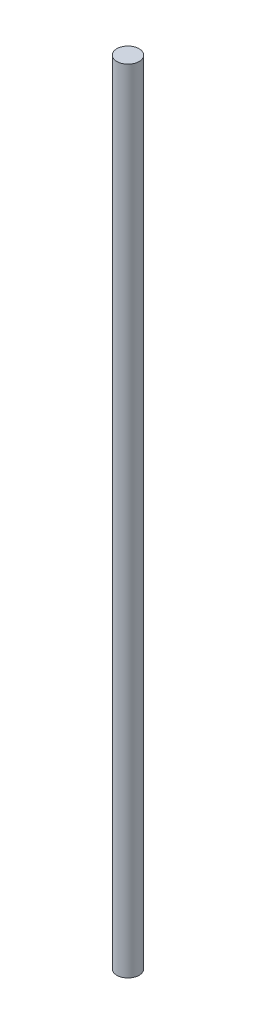
ISO-10303-21;
HEADER;
FILE_DESCRIPTION(('STEP AP214'),'2;1');
FILE_NAME('part.step','',(''),(''),'','','');
FILE_SCHEMA(('AUTOMOTIVE_DESIGN { 1 0 10303 214 1 1 1 1 }'));
ENDSEC;
DATA;
#1=APPLICATION_CONTEXT('core data for automotive mechanical design processes');
#2=APPLICATION_PROTOCOL_DEFINITION('international standard','automotive_design',2000,#1);
#3=PRODUCT_CONTEXT('',#1,'mechanical');
#4=PRODUCT('Part','Part','',(#3));
#5=PRODUCT_RELATED_PRODUCT_CATEGORY('part','',(#4));
#6=PRODUCT_DEFINITION_FORMATION('','',#4);
#7=PRODUCT_DEFINITION_CONTEXT('part definition',#1,'design');
#8=PRODUCT_DEFINITION('design','',#6,#7);
#9=PRODUCT_DEFINITION_SHAPE('','',#8);
#10=(LENGTH_UNIT() NAMED_UNIT(*) SI_UNIT(.MILLI.,.METRE.));
#11=(NAMED_UNIT(*) PLANE_ANGLE_UNIT() SI_UNIT($,.RADIAN.));
#12=(NAMED_UNIT(*) SI_UNIT($,.STERADIAN.) SOLID_ANGLE_UNIT());
#13=UNCERTAINTY_MEASURE_WITH_UNIT(LENGTH_MEASURE(1.E-05),#10,'distance_accuracy_value','');
#14=(GEOMETRIC_REPRESENTATION_CONTEXT(3) GLOBAL_UNCERTAINTY_ASSIGNED_CONTEXT((#13)) GLOBAL_UNIT_ASSIGNED_CONTEXT((#10,
#11,#12)) REPRESENTATION_CONTEXT('',''));
#15=CARTESIAN_POINT('',(0.,0.,0.));
#16=DIRECTION('',(0.,0.,1.));
#17=DIRECTION('',(1.,0.,0.));
#18=AXIS2_PLACEMENT_3D('',#15,#16,#17);
#19=CARTESIAN_POINT('',(0.,177.8,0.));
#20=DIRECTION('',(0.,-1.,0.));
#21=DIRECTION('',(0.,0.,-1.));
#22=AXIS2_PLACEMENT_3D('',#19,#20,#21);
#23=CYLINDRICAL_SURFACE('',#22,2.5);
#24=CARTESIAN_POINT('',(0.,177.8,0.));
#25=DIRECTION('',(0.,1.,0.));
#26=DIRECTION('',(0.,0.,1.));
#27=AXIS2_PLACEMENT_3D('',#24,#25,#26);
#28=CIRCLE('',#27,2.5);
#29=CARTESIAN_POINT('',(0.,177.8,2.5));
#30=VERTEX_POINT('',#29);
#31=EDGE_CURVE('E10',#30,#30,#28,.T.);
#32=ORIENTED_EDGE('',*,*,#31,.F.);
#33=EDGE_LOOP('',(#32));
#34=FACE_BOUND('',#33,.T.);
#35=CARTESIAN_POINT('',(0.,0.,0.));
#36=DIRECTION('',(0.,1.,0.));
#37=DIRECTION('',(0.,0.,1.));
#38=AXIS2_PLACEMENT_3D('',#35,#36,#37);
#39=CIRCLE('',#38,2.5);
#40=CARTESIAN_POINT('',(0.,0.,2.5));
#41=VERTEX_POINT('',#40);
#42=EDGE_CURVE('E46',#41,#41,#39,.T.);
#43=ORIENTED_EDGE('',*,*,#42,.T.);
#44=EDGE_LOOP('',(#43));
#45=FACE_BOUND('',#44,.T.);
#46=ADVANCED_FACE('F43',(#34,#45),#23,.T.);
#47=CARTESIAN_POINT('',(0.,177.8,0.));
#48=DIRECTION('',(0.,1.,0.));
#49=DIRECTION('',(0.,0.,1.));
#50=AXIS2_PLACEMENT_3D('',#47,#48,#49);
#51=PLANE('',#50);
#52=ORIENTED_EDGE('',*,*,#31,.T.);
#53=EDGE_LOOP('',(#52));
#54=FACE_BOUND('',#53,.T.);
#55=ADVANCED_FACE('F60',(#54),#51,.T.);
#56=CARTESIAN_POINT('',(0.,0.,0.));
#57=DIRECTION('',(0.,1.,0.));
#58=DIRECTION('',(0.,0.,1.));
#59=AXIS2_PLACEMENT_3D('',#56,#57,#58);
#60=PLANE('',#59);
#61=ORIENTED_EDGE('',*,*,#42,.F.);
#62=EDGE_LOOP('',(#61));
#63=FACE_BOUND('',#62,.T.);
#64=ADVANCED_FACE('F58',(#63),#60,.F.);
#65=CLOSED_SHELL('',(#46,#55,#64));
#66=MANIFOLD_SOLID_BREP('B2',#65);
#67=ADVANCED_BREP_SHAPE_REPRESENTATION('',(#18,#66),#14);
#68=SHAPE_DEFINITION_REPRESENTATION(#9,#67);
ENDSEC;
END-ISO-10303-21;
